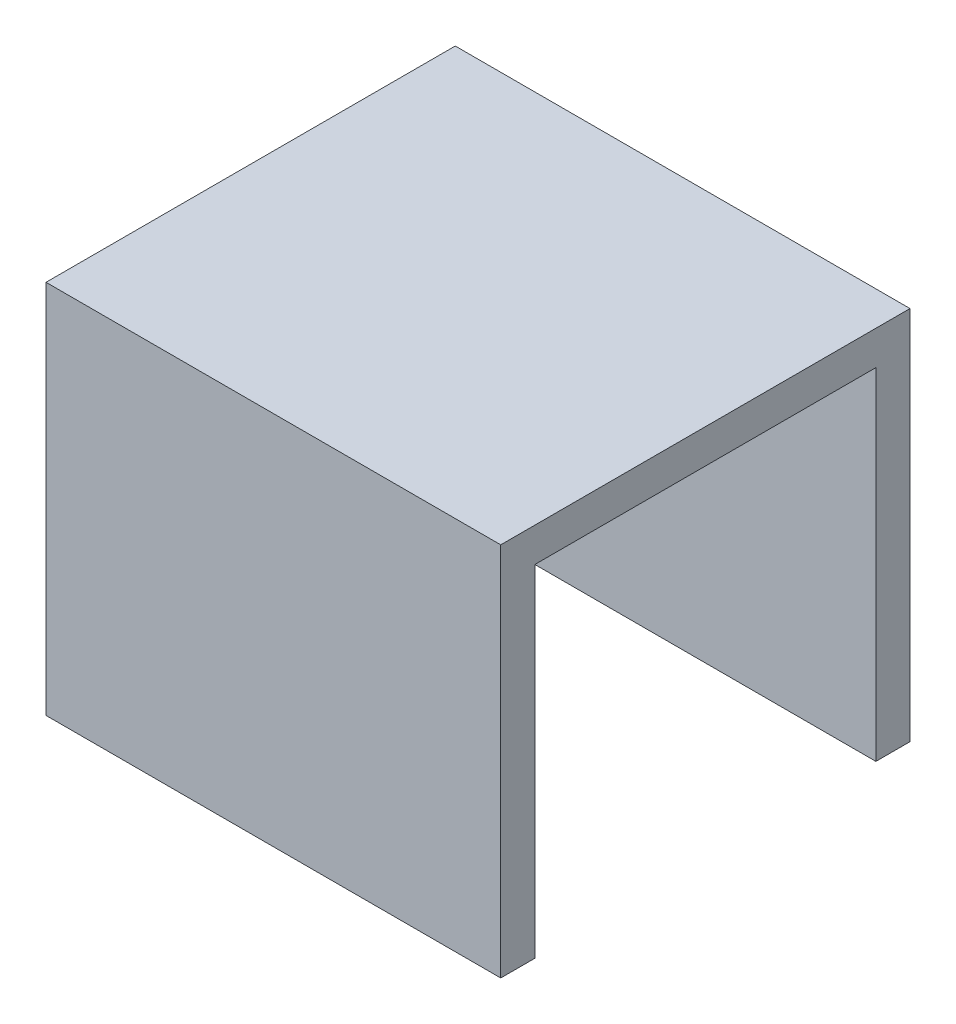
ISO-10303-21;
HEADER;
FILE_DESCRIPTION(('STEP AP214'),'2;1');
FILE_NAME('part.step','',(''),(''),'','','');
FILE_SCHEMA(('AUTOMOTIVE_DESIGN { 1 0 10303 214 1 1 1 1 }'));
ENDSEC;
DATA;
#1=APPLICATION_CONTEXT('core data for automotive mechanical design processes');
#2=APPLICATION_PROTOCOL_DEFINITION('international standard','automotive_design',2000,#1);
#3=PRODUCT_CONTEXT('',#1,'mechanical');
#4=PRODUCT('Part','Part','',(#3));
#5=PRODUCT_RELATED_PRODUCT_CATEGORY('part','',(#4));
#6=PRODUCT_DEFINITION_FORMATION('','',#4);
#7=PRODUCT_DEFINITION_CONTEXT('part definition',#1,'design');
#8=PRODUCT_DEFINITION('design','',#6,#7);
#9=PRODUCT_DEFINITION_SHAPE('','',#8);
#10=(LENGTH_UNIT() NAMED_UNIT(*) SI_UNIT(.MILLI.,.METRE.));
#11=(NAMED_UNIT(*) PLANE_ANGLE_UNIT() SI_UNIT($,.RADIAN.));
#12=(NAMED_UNIT(*) SI_UNIT($,.STERADIAN.) SOLID_ANGLE_UNIT());
#13=UNCERTAINTY_MEASURE_WITH_UNIT(LENGTH_MEASURE(1.E-05),#10,'distance_accuracy_value','');
#14=(GEOMETRIC_REPRESENTATION_CONTEXT(3) GLOBAL_UNCERTAINTY_ASSIGNED_CONTEXT((#13)) GLOBAL_UNIT_ASSIGNED_CONTEXT((#10,
#11,#12)) REPRESENTATION_CONTEXT('',''));
#15=CARTESIAN_POINT('',(0.,0.,0.));
#16=DIRECTION('',(0.,0.,1.));
#17=DIRECTION('',(1.,0.,0.));
#18=AXIS2_PLACEMENT_3D('',#15,#16,#17);
#19=CARTESIAN_POINT('',(0.,0.,0.));
#20=DIRECTION('',(0.,1.,0.));
#21=DIRECTION('',(0.,0.,1.));
#22=AXIS2_PLACEMENT_3D('',#19,#20,#21);
#23=PLANE('',#22);
#24=DIRECTION('',(0.,0.,-1.));
#25=VECTOR('',#24,1.);
#26=CARTESIAN_POINT('',(10.,0.,9.));
#27=LINE('',#26,#25);
#28=CARTESIAN_POINT('',(10.,0.,-7.5));
#29=VERTEX_POINT('',#28);
#30=CARTESIAN_POINT('',(10.,0.,-9.));
#31=VERTEX_POINT('',#30);
#32=EDGE_CURVE('E124',#29,#31,#27,.T.);
#33=ORIENTED_EDGE('',*,*,#32,.F.);
#34=DIRECTION('',(-1.,0.,0.));
#35=VECTOR('',#34,1.);
#36=CARTESIAN_POINT('',(10.001,0.,-7.5));
#37=LINE('',#36,#35);
#38=CARTESIAN_POINT('',(-10.,0.,-7.5));
#39=VERTEX_POINT('',#38);
#40=EDGE_CURVE('E107',#29,#39,#37,.T.);
#41=ORIENTED_EDGE('',*,*,#40,.T.);
#42=DIRECTION('',(0.,0.,1.));
#43=VECTOR('',#42,1.);
#44=CARTESIAN_POINT('',(-10.,0.,9.));
#45=LINE('',#44,#43);
#46=CARTESIAN_POINT('',(-10.,0.,-9.));
#47=VERTEX_POINT('',#46);
#48=EDGE_CURVE('E132',#47,#39,#45,.T.);
#49=ORIENTED_EDGE('',*,*,#48,.F.);
#50=DIRECTION('',(-1.,0.,0.));
#51=VECTOR('',#50,1.);
#52=CARTESIAN_POINT('',(10.,0.,-9.));
#53=LINE('',#52,#51);
#54=EDGE_CURVE('E78',#31,#47,#53,.T.);
#55=ORIENTED_EDGE('',*,*,#54,.F.);
#56=EDGE_LOOP('',(#33,#41,#49,#55));
#57=FACE_BOUND('',#56,.T.);
#58=ADVANCED_FACE('F33',(#57),#23,.F.);
#59=CARTESIAN_POINT('',(-10.,16.5,9.));
#60=DIRECTION('',(1.,0.,0.));
#61=DIRECTION('',(0.,0.,-1.));
#62=AXIS2_PLACEMENT_3D('',#59,#60,#61);
#63=PLANE('',#62);
#64=ORIENTED_EDGE('',*,*,#48,.T.);
#65=DIRECTION('',(0.,-1.,0.));
#66=VECTOR('',#65,1.);
#67=CARTESIAN_POINT('',(-10.,0.,-7.5));
#68=LINE('',#67,#66);
#69=CARTESIAN_POINT('',(-10.,15.,-7.5));
#70=VERTEX_POINT('',#69);
#71=EDGE_CURVE('E113',#70,#39,#68,.T.);
#72=ORIENTED_EDGE('',*,*,#71,.F.);
#73=DIRECTION('',(0.,0.,-1.));
#74=VECTOR('',#73,1.);
#75=CARTESIAN_POINT('',(-10.,15.,-7.5));
#76=LINE('',#75,#74);
#77=CARTESIAN_POINT('',(-10.,15.,7.5));
#78=VERTEX_POINT('',#77);
#79=EDGE_CURVE('E119',#78,#70,#76,.T.);
#80=ORIENTED_EDGE('',*,*,#79,.F.);
#81=DIRECTION('',(0.,1.,0.));
#82=VECTOR('',#81,1.);
#83=CARTESIAN_POINT('',(-10.,0.,7.5));
#84=LINE('',#83,#82);
#85=CARTESIAN_POINT('',(-10.,0.,7.5));
#86=VERTEX_POINT('',#85);
#87=EDGE_CURVE('E166',#86,#78,#84,.T.);
#88=ORIENTED_EDGE('',*,*,#87,.F.);
#89=CARTESIAN_POINT('',(-10.,0.,9.));
#90=VERTEX_POINT('',#89);
#91=EDGE_CURVE('E149',#86,#90,#45,.T.);
#92=ORIENTED_EDGE('',*,*,#91,.T.);
#93=DIRECTION('',(0.,-1.,0.));
#94=VECTOR('',#93,1.);
#95=CARTESIAN_POINT('',(-10.,16.5,9.));
#96=LINE('',#95,#94);
#97=CARTESIAN_POINT('',(-10.,16.5,9.));
#98=VERTEX_POINT('',#97);
#99=EDGE_CURVE('E11',#98,#90,#96,.T.);
#100=ORIENTED_EDGE('',*,*,#99,.F.);
#101=DIRECTION('',(0.,0.,1.));
#102=VECTOR('',#101,1.);
#103=CARTESIAN_POINT('',(-10.,16.5,9.));
#104=LINE('',#103,#102);
#105=CARTESIAN_POINT('',(-10.,16.5,-9.));
#106=VERTEX_POINT('',#105);
#107=EDGE_CURVE('E137',#106,#98,#104,.T.);
#108=ORIENTED_EDGE('',*,*,#107,.F.);
#109=DIRECTION('',(0.,-1.,0.));
#110=VECTOR('',#109,1.);
#111=CARTESIAN_POINT('',(-10.,16.5,-9.));
#112=LINE('',#111,#110);
#113=EDGE_CURVE('E138',#106,#47,#112,.T.);
#114=ORIENTED_EDGE('',*,*,#113,.T.);
#115=EDGE_LOOP('',(#64,#72,#80,#88,#92,#100,#108,#114));
#116=FACE_BOUND('',#115,.T.);
#117=ADVANCED_FACE('F35',(#116),#63,.F.);
#118=CARTESIAN_POINT('',(10.,16.5,9.));
#119=DIRECTION('',(0.,0.,-1.));
#120=DIRECTION('',(-1.,0.,0.));
#121=AXIS2_PLACEMENT_3D('',#118,#119,#120);
#122=PLANE('',#121);
#123=DIRECTION('',(1.,0.,0.));
#124=VECTOR('',#123,1.);
#125=CARTESIAN_POINT('',(10.,0.,9.));
#126=LINE('',#125,#124);
#127=CARTESIAN_POINT('',(10.,0.,9.));
#128=VERTEX_POINT('',#127);
#129=EDGE_CURVE('E129',#90,#128,#126,.T.);
#130=ORIENTED_EDGE('',*,*,#129,.T.);
#131=DIRECTION('',(0.,-1.,0.));
#132=VECTOR('',#131,1.);
#133=CARTESIAN_POINT('',(10.,16.5,9.));
#134=LINE('',#133,#132);
#135=CARTESIAN_POINT('',(10.,16.5,9.));
#136=VERTEX_POINT('',#135);
#137=EDGE_CURVE('E41',#136,#128,#134,.T.);
#138=ORIENTED_EDGE('',*,*,#137,.F.);
#139=DIRECTION('',(1.,0.,0.));
#140=VECTOR('',#139,1.);
#141=CARTESIAN_POINT('',(10.,16.5,9.));
#142=LINE('',#141,#140);
#143=EDGE_CURVE('E85',#98,#136,#142,.T.);
#144=ORIENTED_EDGE('',*,*,#143,.F.);
#145=ORIENTED_EDGE('',*,*,#99,.T.);
#146=EDGE_LOOP('',(#130,#138,#144,#145));
#147=FACE_BOUND('',#146,.T.);
#148=ADVANCED_FACE('F174',(#147),#122,.F.);
#149=CARTESIAN_POINT('',(10.,16.5,9.));
#150=DIRECTION('',(-1.,0.,0.));
#151=DIRECTION('',(0.,0.,1.));
#152=AXIS2_PLACEMENT_3D('',#149,#150,#151);
#153=PLANE('',#152);
#154=DIRECTION('',(0.,0.,1.));
#155=VECTOR('',#154,1.);
#156=CARTESIAN_POINT('',(10.,15.,-7.5));
#157=LINE('',#156,#155);
#158=CARTESIAN_POINT('',(10.,15.,-7.5));
#159=VERTEX_POINT('',#158);
#160=CARTESIAN_POINT('',(10.,15.,7.5));
#161=VERTEX_POINT('',#160);
#162=EDGE_CURVE('E126',#159,#161,#157,.T.);
#163=ORIENTED_EDGE('',*,*,#162,.F.);
#164=DIRECTION('',(0.,1.,0.));
#165=VECTOR('',#164,1.);
#166=CARTESIAN_POINT('',(10.,0.,-7.5));
#167=LINE('',#166,#165);
#168=EDGE_CURVE('E110',#29,#159,#167,.T.);
#169=ORIENTED_EDGE('',*,*,#168,.F.);
#170=ORIENTED_EDGE('',*,*,#32,.T.);
#171=DIRECTION('',(0.,-1.,0.));
#172=VECTOR('',#171,1.);
#173=CARTESIAN_POINT('',(10.,16.5,-9.));
#174=LINE('',#173,#172);
#175=CARTESIAN_POINT('',(10.,16.5,-9.));
#176=VERTEX_POINT('',#175);
#177=EDGE_CURVE('E140',#176,#31,#174,.T.);
#178=ORIENTED_EDGE('',*,*,#177,.F.);
#179=DIRECTION('',(0.,0.,-1.));
#180=VECTOR('',#179,1.);
#181=CARTESIAN_POINT('',(10.,16.5,9.));
#182=LINE('',#181,#180);
#183=EDGE_CURVE('E144',#136,#176,#182,.T.);
#184=ORIENTED_EDGE('',*,*,#183,.F.);
#185=ORIENTED_EDGE('',*,*,#137,.T.);
#186=CARTESIAN_POINT('',(10.,0.,7.5));
#187=VERTEX_POINT('',#186);
#188=EDGE_CURVE('E128',#128,#187,#27,.T.);
#189=ORIENTED_EDGE('',*,*,#188,.T.);
#190=DIRECTION('',(0.,-1.,0.));
#191=VECTOR('',#190,1.);
#192=CARTESIAN_POINT('',(10.,0.,7.5));
#193=LINE('',#192,#191);
#194=EDGE_CURVE('E48',#161,#187,#193,.T.);
#195=ORIENTED_EDGE('',*,*,#194,.F.);
#196=EDGE_LOOP('',(#163,#169,#170,#178,#184,#185,#189,#195));
#197=FACE_BOUND('',#196,.T.);
#198=ADVANCED_FACE('F122',(#197),#153,.F.);
#199=CARTESIAN_POINT('',(10.,16.5,-9.));
#200=DIRECTION('',(0.,0.,1.));
#201=DIRECTION('',(1.,0.,0.));
#202=AXIS2_PLACEMENT_3D('',#199,#200,#201);
#203=PLANE('',#202);
#204=ORIENTED_EDGE('',*,*,#54,.T.);
#205=ORIENTED_EDGE('',*,*,#113,.F.);
#206=DIRECTION('',(-1.,0.,0.));
#207=VECTOR('',#206,1.);
#208=CARTESIAN_POINT('',(10.,16.5,-9.));
#209=LINE('',#208,#207);
#210=EDGE_CURVE('E57',#176,#106,#209,.T.);
#211=ORIENTED_EDGE('',*,*,#210,.F.);
#212=ORIENTED_EDGE('',*,*,#177,.T.);
#213=EDGE_LOOP('',(#204,#205,#211,#212));
#214=FACE_BOUND('',#213,.T.);
#215=ADVANCED_FACE('F191',(#214),#203,.F.);
#216=CARTESIAN_POINT('',(0.,16.5,0.));
#217=DIRECTION('',(0.,1.,0.));
#218=DIRECTION('',(0.,0.,1.));
#219=AXIS2_PLACEMENT_3D('',#216,#217,#218);
#220=PLANE('',#219);
#221=ORIENTED_EDGE('',*,*,#107,.T.);
#222=ORIENTED_EDGE('',*,*,#143,.T.);
#223=ORIENTED_EDGE('',*,*,#183,.T.);
#224=ORIENTED_EDGE('',*,*,#210,.T.);
#225=EDGE_LOOP('',(#221,#222,#223,#224));
#226=FACE_BOUND('',#225,.T.);
#227=ADVANCED_FACE('F185',(#226),#220,.T.);
#228=ORIENTED_EDGE('',*,*,#91,.F.);
#229=DIRECTION('',(-1.,0.,0.));
#230=VECTOR('',#229,1.);
#231=CARTESIAN_POINT('',(10.001,0.,7.5));
#232=LINE('',#231,#230);
#233=EDGE_CURVE('E118',#187,#86,#232,.T.);
#234=ORIENTED_EDGE('',*,*,#233,.F.);
#235=ORIENTED_EDGE('',*,*,#188,.F.);
#236=ORIENTED_EDGE('',*,*,#129,.F.);
#237=EDGE_LOOP('',(#228,#234,#235,#236));
#238=FACE_BOUND('',#237,.T.);
#239=ADVANCED_FACE('F148',(#238),#23,.F.);
#240=CARTESIAN_POINT('',(10.001,0.,-7.5));
#241=DIRECTION('',(0.,0.,-1.));
#242=DIRECTION('',(-1.,0.,0.));
#243=AXIS2_PLACEMENT_3D('',#240,#241,#242);
#244=PLANE('',#243);
#245=ORIENTED_EDGE('',*,*,#168,.T.);
#246=DIRECTION('',(-1.,0.,0.));
#247=VECTOR('',#246,1.);
#248=CARTESIAN_POINT('',(10.001,15.,-7.5));
#249=LINE('',#248,#247);
#250=EDGE_CURVE('E154',#159,#70,#249,.T.);
#251=ORIENTED_EDGE('',*,*,#250,.T.);
#252=ORIENTED_EDGE('',*,*,#71,.T.);
#253=ORIENTED_EDGE('',*,*,#40,.F.);
#254=EDGE_LOOP('',(#245,#251,#252,#253));
#255=FACE_BOUND('',#254,.T.);
#256=ADVANCED_FACE('F109',(#255),#244,.F.);
#257=CARTESIAN_POINT('',(10.001,15.,-7.5));
#258=DIRECTION('',(0.,1.,0.));
#259=DIRECTION('',(0.,0.,1.));
#260=AXIS2_PLACEMENT_3D('',#257,#258,#259);
#261=PLANE('',#260);
#262=ORIENTED_EDGE('',*,*,#162,.T.);
#263=DIRECTION('',(-1.,0.,0.));
#264=VECTOR('',#263,1.);
#265=CARTESIAN_POINT('',(10.001,15.,7.5));
#266=LINE('',#265,#264);
#267=EDGE_CURVE('E152',#161,#78,#266,.T.);
#268=ORIENTED_EDGE('',*,*,#267,.T.);
#269=ORIENTED_EDGE('',*,*,#79,.T.);
#270=ORIENTED_EDGE('',*,*,#250,.F.);
#271=EDGE_LOOP('',(#262,#268,#269,#270));
#272=FACE_BOUND('',#271,.T.);
#273=ADVANCED_FACE('F171',(#272),#261,.F.);
#274=CARTESIAN_POINT('',(10.001,0.,7.5));
#275=DIRECTION('',(0.,0.,1.));
#276=DIRECTION('',(1.,0.,0.));
#277=AXIS2_PLACEMENT_3D('',#274,#275,#276);
#278=PLANE('',#277);
#279=ORIENTED_EDGE('',*,*,#194,.T.);
#280=ORIENTED_EDGE('',*,*,#233,.T.);
#281=ORIENTED_EDGE('',*,*,#87,.T.);
#282=ORIENTED_EDGE('',*,*,#267,.F.);
#283=EDGE_LOOP('',(#279,#280,#281,#282));
#284=FACE_BOUND('',#283,.T.);
#285=ADVANCED_FACE('F196',(#284),#278,.F.);
#286=CLOSED_SHELL('',(#58,#117,#148,#198,#215,#227,#239,#256,#273,#285));
#287=MANIFOLD_SOLID_BREP('B2',#286);
#288=ADVANCED_BREP_SHAPE_REPRESENTATION('',(#18,#287),#14);
#289=SHAPE_DEFINITION_REPRESENTATION(#9,#288);
ENDSEC;
END-ISO-10303-21;
